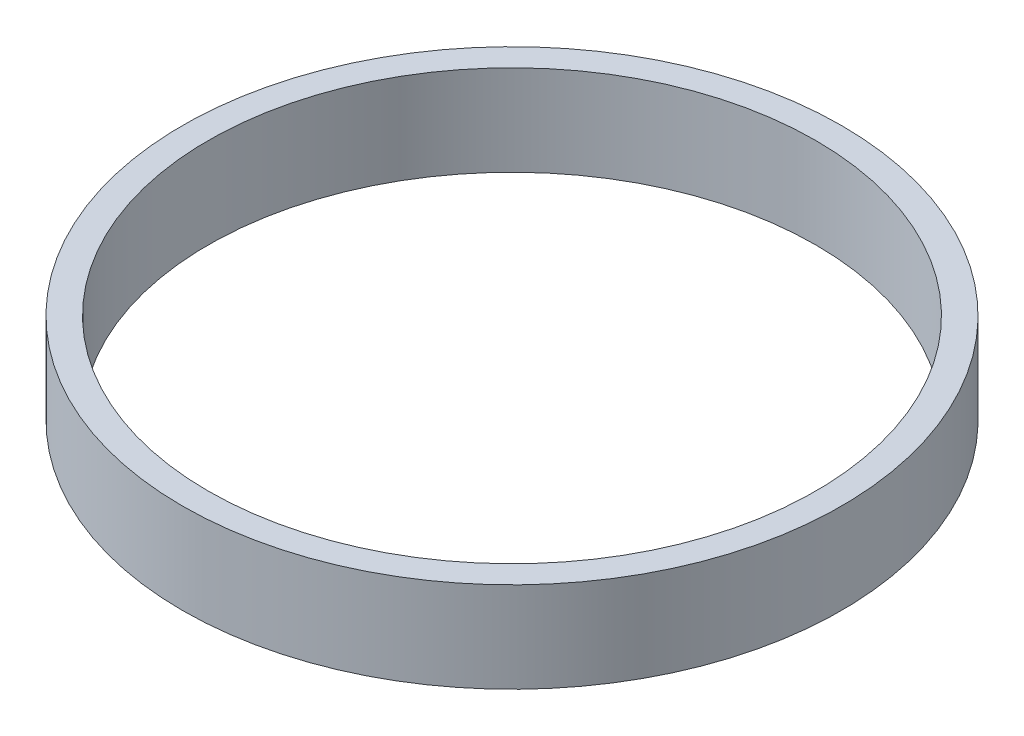
ISO-10303-21;
HEADER;
FILE_DESCRIPTION(('STEP AP214'),'2;1');
FILE_NAME('part.step','',(''),(''),'','','');
FILE_SCHEMA(('AUTOMOTIVE_DESIGN { 1 0 10303 214 1 1 1 1 }'));
ENDSEC;
DATA;
#1=APPLICATION_CONTEXT('core data for automotive mechanical design processes');
#2=APPLICATION_PROTOCOL_DEFINITION('international standard','automotive_design',2000,#1);
#3=PRODUCT_CONTEXT('',#1,'mechanical');
#4=PRODUCT('Part','Part','',(#3));
#5=PRODUCT_RELATED_PRODUCT_CATEGORY('part','',(#4));
#6=PRODUCT_DEFINITION_FORMATION('','',#4);
#7=PRODUCT_DEFINITION_CONTEXT('part definition',#1,'design');
#8=PRODUCT_DEFINITION('design','',#6,#7);
#9=PRODUCT_DEFINITION_SHAPE('','',#8);
#10=(LENGTH_UNIT() NAMED_UNIT(*) SI_UNIT(.MILLI.,.METRE.));
#11=(NAMED_UNIT(*) PLANE_ANGLE_UNIT() SI_UNIT($,.RADIAN.));
#12=(NAMED_UNIT(*) SI_UNIT($,.STERADIAN.) SOLID_ANGLE_UNIT());
#13=UNCERTAINTY_MEASURE_WITH_UNIT(LENGTH_MEASURE(1.E-05),#10,'distance_accuracy_value','');
#14=(GEOMETRIC_REPRESENTATION_CONTEXT(3) GLOBAL_UNCERTAINTY_ASSIGNED_CONTEXT((#13)) GLOBAL_UNIT_ASSIGNED_CONTEXT((#10,
#11,#12)) REPRESENTATION_CONTEXT('',''));
#15=CARTESIAN_POINT('',(0.,0.,0.));
#16=DIRECTION('',(0.,0.,1.));
#17=DIRECTION('',(1.,0.,0.));
#18=AXIS2_PLACEMENT_3D('',#15,#16,#17);
#19=CARTESIAN_POINT('',(0.,7.,0.));
#20=DIRECTION('',(0.,1.,0.));
#21=DIRECTION('',(0.,0.,1.));
#22=AXIS2_PLACEMENT_3D('',#19,#20,#21);
#23=PLANE('',#22);
#24=CARTESIAN_POINT('',(0.,7.,0.));
#25=DIRECTION('',(0.,1.,0.));
#26=DIRECTION('',(0.,0.,1.));
#27=AXIS2_PLACEMENT_3D('',#24,#25,#26);
#28=CIRCLE('',#27,25.5);
#29=CARTESIAN_POINT('',(0.,7.,25.5));
#30=VERTEX_POINT('',#29);
#31=EDGE_CURVE('E10',#30,#30,#28,.T.);
#32=ORIENTED_EDGE('',*,*,#31,.T.);
#33=EDGE_LOOP('',(#32));
#34=FACE_BOUND('',#33,.T.);
#35=CARTESIAN_POINT('',(0.,7.,0.));
#36=DIRECTION('',(0.,1.,0.));
#37=DIRECTION('',(0.,0.,1.));
#38=AXIS2_PLACEMENT_3D('',#35,#36,#37);
#39=CIRCLE('',#38,23.5);
#40=CARTESIAN_POINT('',(0.,7.,23.5));
#41=VERTEX_POINT('',#40);
#42=EDGE_CURVE('E43',#41,#41,#39,.T.);
#43=ORIENTED_EDGE('',*,*,#42,.F.);
#44=EDGE_LOOP('',(#43));
#45=FACE_BOUND('',#44,.T.);
#46=ADVANCED_FACE('F32',(#34,#45),#23,.T.);
#47=CARTESIAN_POINT('',(0.,0.,0.));
#48=DIRECTION('',(0.,1.,0.));
#49=DIRECTION('',(0.,0.,1.));
#50=AXIS2_PLACEMENT_3D('',#47,#48,#49);
#51=PLANE('',#50);
#52=CARTESIAN_POINT('',(0.,0.,0.));
#53=DIRECTION('',(0.,1.,0.));
#54=DIRECTION('',(0.,0.,1.));
#55=AXIS2_PLACEMENT_3D('',#52,#53,#54);
#56=CIRCLE('',#55,25.5);
#57=CARTESIAN_POINT('',(0.,0.,25.5));
#58=VERTEX_POINT('',#57);
#59=EDGE_CURVE('E36',#58,#58,#56,.T.);
#60=ORIENTED_EDGE('',*,*,#59,.F.);
#61=EDGE_LOOP('',(#60));
#62=FACE_BOUND('',#61,.T.);
#63=CARTESIAN_POINT('',(0.,0.,0.));
#64=DIRECTION('',(0.,1.,0.));
#65=DIRECTION('',(0.,0.,1.));
#66=AXIS2_PLACEMENT_3D('',#63,#64,#65);
#67=CIRCLE('',#66,23.5);
#68=CARTESIAN_POINT('',(0.,0.,23.5));
#69=VERTEX_POINT('',#68);
#70=EDGE_CURVE('E45',#69,#69,#67,.T.);
#71=ORIENTED_EDGE('',*,*,#70,.T.);
#72=EDGE_LOOP('',(#71));
#73=FACE_BOUND('',#72,.T.);
#74=ADVANCED_FACE('F55',(#62,#73),#51,.F.);
#75=CARTESIAN_POINT('',(0.,7.,0.));
#76=DIRECTION('',(0.,-1.,0.));
#77=DIRECTION('',(0.,0.,-1.));
#78=AXIS2_PLACEMENT_3D('',#75,#76,#77);
#79=CYLINDRICAL_SURFACE('',#78,25.5);
#80=ORIENTED_EDGE('',*,*,#31,.F.);
#81=EDGE_LOOP('',(#80));
#82=FACE_BOUND('',#81,.T.);
#83=ORIENTED_EDGE('',*,*,#59,.T.);
#84=EDGE_LOOP('',(#83));
#85=FACE_BOUND('',#84,.T.);
#86=ADVANCED_FACE('F34',(#82,#85),#79,.T.);
#87=CARTESIAN_POINT('',(0.,7.,0.));
#88=DIRECTION('',(0.,-1.,0.));
#89=DIRECTION('',(0.,0.,-1.));
#90=AXIS2_PLACEMENT_3D('',#87,#88,#89);
#91=CYLINDRICAL_SURFACE('',#90,23.5);
#92=ORIENTED_EDGE('',*,*,#42,.T.);
#93=EDGE_LOOP('',(#92));
#94=FACE_BOUND('',#93,.T.);
#95=ORIENTED_EDGE('',*,*,#70,.F.);
#96=EDGE_LOOP('',(#95));
#97=FACE_BOUND('',#96,.T.);
#98=ADVANCED_FACE('F51',(#94,#97),#91,.F.);
#99=CLOSED_SHELL('',(#46,#74,#86,#98));
#100=MANIFOLD_SOLID_BREP('B2',#99);
#101=ADVANCED_BREP_SHAPE_REPRESENTATION('',(#18,#100),#14);
#102=SHAPE_DEFINITION_REPRESENTATION(#9,#101);
ENDSEC;
END-ISO-10303-21;
